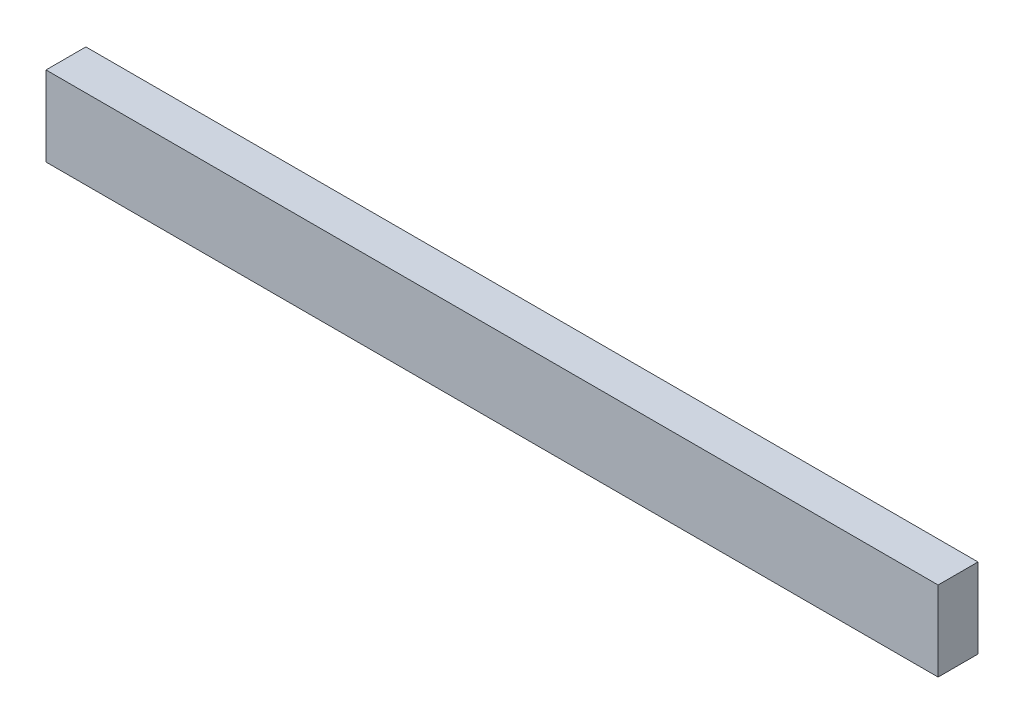
ISO-10303-21;
HEADER;
FILE_DESCRIPTION(('STEP AP214'),'2;1');
FILE_NAME('part.step','',(''),(''),'','','');
FILE_SCHEMA(('AUTOMOTIVE_DESIGN { 1 0 10303 214 1 1 1 1 }'));
ENDSEC;
DATA;
#1=APPLICATION_CONTEXT('core data for automotive mechanical design processes');
#2=APPLICATION_PROTOCOL_DEFINITION('international standard','automotive_design',2000,#1);
#3=PRODUCT_CONTEXT('',#1,'mechanical');
#4=PRODUCT('Part','Part','',(#3));
#5=PRODUCT_RELATED_PRODUCT_CATEGORY('part','',(#4));
#6=PRODUCT_DEFINITION_FORMATION('','',#4);
#7=PRODUCT_DEFINITION_CONTEXT('part definition',#1,'design');
#8=PRODUCT_DEFINITION('design','',#6,#7);
#9=PRODUCT_DEFINITION_SHAPE('','',#8);
#10=(LENGTH_UNIT() NAMED_UNIT(*) SI_UNIT(.MILLI.,.METRE.));
#11=(NAMED_UNIT(*) PLANE_ANGLE_UNIT() SI_UNIT($,.RADIAN.));
#12=(NAMED_UNIT(*) SI_UNIT($,.STERADIAN.) SOLID_ANGLE_UNIT());
#13=UNCERTAINTY_MEASURE_WITH_UNIT(LENGTH_MEASURE(1.E-05),#10,'distance_accuracy_value','');
#14=(GEOMETRIC_REPRESENTATION_CONTEXT(3) GLOBAL_UNCERTAINTY_ASSIGNED_CONTEXT((#13)) GLOBAL_UNIT_ASSIGNED_CONTEXT((#10,
#11,#12)) REPRESENTATION_CONTEXT('',''));
#15=CARTESIAN_POINT('',(0.,0.,0.));
#16=DIRECTION('',(0.,0.,1.));
#17=DIRECTION('',(1.,0.,0.));
#18=AXIS2_PLACEMENT_3D('',#15,#16,#17);
#19=CARTESIAN_POINT('',(568.,-25.4,-12.7));
#20=DIRECTION('',(0.,0.,1.));
#21=DIRECTION('',(1.,0.,0.));
#22=AXIS2_PLACEMENT_3D('',#19,#20,#21);
#23=PLANE('',#22);
#24=DIRECTION('',(0.,1.,0.));
#25=VECTOR('',#24,1.);
#26=CARTESIAN_POINT('',(0.,-25.4,-12.7));
#27=LINE('',#26,#25);
#28=CARTESIAN_POINT('',(0.,-25.4,-12.7));
#29=VERTEX_POINT('',#28);
#30=CARTESIAN_POINT('',(0.,25.4,-12.7));
#31=VERTEX_POINT('',#30);
#32=EDGE_CURVE('E96',#29,#31,#27,.T.);
#33=ORIENTED_EDGE('',*,*,#32,.T.);
#34=DIRECTION('',(-1.,0.,0.));
#35=VECTOR('',#34,1.);
#36=CARTESIAN_POINT('',(568.,25.4,-12.7));
#37=LINE('',#36,#35);
#38=CARTESIAN_POINT('',(568.,25.4,-12.7));
#39=VERTEX_POINT('',#38);
#40=EDGE_CURVE('E11',#39,#31,#37,.T.);
#41=ORIENTED_EDGE('',*,*,#40,.F.);
#42=DIRECTION('',(0.,1.,0.));
#43=VECTOR('',#42,1.);
#44=CARTESIAN_POINT('',(568.,-25.4,-12.7));
#45=LINE('',#44,#43);
#46=CARTESIAN_POINT('',(568.,-25.4,-12.7));
#47=VERTEX_POINT('',#46);
#48=EDGE_CURVE('E84',#47,#39,#45,.T.);
#49=ORIENTED_EDGE('',*,*,#48,.F.);
#50=DIRECTION('',(-1.,0.,0.));
#51=VECTOR('',#50,1.);
#52=CARTESIAN_POINT('',(568.,-25.4,-12.7));
#53=LINE('',#52,#51);
#54=EDGE_CURVE('E92',#47,#29,#53,.T.);
#55=ORIENTED_EDGE('',*,*,#54,.T.);
#56=EDGE_LOOP('',(#33,#41,#49,#55));
#57=FACE_BOUND('',#56,.T.);
#58=ADVANCED_FACE('F33',(#57),#23,.F.);
#59=CARTESIAN_POINT('',(568.,25.4,12.7));
#60=DIRECTION('',(0.,-1.,0.));
#61=DIRECTION('',(0.,0.,-1.));
#62=AXIS2_PLACEMENT_3D('',#59,#60,#61);
#63=PLANE('',#62);
#64=DIRECTION('',(0.,0.,1.));
#65=VECTOR('',#64,1.);
#66=CARTESIAN_POINT('',(0.,25.4,12.7));
#67=LINE('',#66,#65);
#68=CARTESIAN_POINT('',(0.,25.4,12.7));
#69=VERTEX_POINT('',#68);
#70=EDGE_CURVE('E88',#31,#69,#67,.T.);
#71=ORIENTED_EDGE('',*,*,#70,.T.);
#72=DIRECTION('',(-1.,0.,0.));
#73=VECTOR('',#72,1.);
#74=CARTESIAN_POINT('',(568.,25.4,12.7));
#75=LINE('',#74,#73);
#76=CARTESIAN_POINT('',(568.,25.4,12.7));
#77=VERTEX_POINT('',#76);
#78=EDGE_CURVE('E41',#77,#69,#75,.T.);
#79=ORIENTED_EDGE('',*,*,#78,.F.);
#80=DIRECTION('',(0.,0.,1.));
#81=VECTOR('',#80,1.);
#82=CARTESIAN_POINT('',(568.,25.4,12.7));
#83=LINE('',#82,#81);
#84=EDGE_CURVE('E79',#39,#77,#83,.T.);
#85=ORIENTED_EDGE('',*,*,#84,.F.);
#86=ORIENTED_EDGE('',*,*,#40,.T.);
#87=EDGE_LOOP('',(#71,#79,#85,#86));
#88=FACE_BOUND('',#87,.T.);
#89=ADVANCED_FACE('F87',(#88),#63,.F.);
#90=CARTESIAN_POINT('',(568.,-25.4,12.7));
#91=DIRECTION('',(0.,0.,-1.));
#92=DIRECTION('',(-1.,0.,0.));
#93=AXIS2_PLACEMENT_3D('',#90,#91,#92);
#94=PLANE('',#93);
#95=DIRECTION('',(0.,-1.,0.));
#96=VECTOR('',#95,1.);
#97=CARTESIAN_POINT('',(0.,-25.4,12.7));
#98=LINE('',#97,#96);
#99=CARTESIAN_POINT('',(0.,-25.4,12.7));
#100=VERTEX_POINT('',#99);
#101=EDGE_CURVE('E66',#69,#100,#98,.T.);
#102=ORIENTED_EDGE('',*,*,#101,.T.);
#103=DIRECTION('',(-1.,0.,0.));
#104=VECTOR('',#103,1.);
#105=CARTESIAN_POINT('',(568.,-25.4,12.7));
#106=LINE('',#105,#104);
#107=CARTESIAN_POINT('',(568.,-25.4,12.7));
#108=VERTEX_POINT('',#107);
#109=EDGE_CURVE('E89',#108,#100,#106,.T.);
#110=ORIENTED_EDGE('',*,*,#109,.F.);
#111=DIRECTION('',(0.,-1.,0.));
#112=VECTOR('',#111,1.);
#113=CARTESIAN_POINT('',(568.,-25.4,12.7));
#114=LINE('',#113,#112);
#115=EDGE_CURVE('E82',#77,#108,#114,.T.);
#116=ORIENTED_EDGE('',*,*,#115,.F.);
#117=ORIENTED_EDGE('',*,*,#78,.T.);
#118=EDGE_LOOP('',(#102,#110,#116,#117));
#119=FACE_BOUND('',#118,.T.);
#120=ADVANCED_FACE('F90',(#119),#94,.F.);
#121=CARTESIAN_POINT('',(568.,-25.4,12.7));
#122=DIRECTION('',(0.,1.,0.));
#123=DIRECTION('',(0.,0.,1.));
#124=AXIS2_PLACEMENT_3D('',#121,#122,#123);
#125=PLANE('',#124);
#126=DIRECTION('',(0.,0.,-1.));
#127=VECTOR('',#126,1.);
#128=CARTESIAN_POINT('',(0.,-25.4,12.7));
#129=LINE('',#128,#127);
#130=EDGE_CURVE('E72',#100,#29,#129,.T.);
#131=ORIENTED_EDGE('',*,*,#130,.T.);
#132=ORIENTED_EDGE('',*,*,#54,.F.);
#133=DIRECTION('',(0.,0.,-1.));
#134=VECTOR('',#133,1.);
#135=CARTESIAN_POINT('',(568.,-25.4,12.7));
#136=LINE('',#135,#134);
#137=EDGE_CURVE('E49',#108,#47,#136,.T.);
#138=ORIENTED_EDGE('',*,*,#137,.F.);
#139=ORIENTED_EDGE('',*,*,#109,.T.);
#140=EDGE_LOOP('',(#131,#132,#138,#139));
#141=FACE_BOUND('',#140,.T.);
#142=ADVANCED_FACE('F103',(#141),#125,.F.);
#143=CARTESIAN_POINT('',(568.,0.,0.));
#144=DIRECTION('',(-1.,0.,0.));
#145=DIRECTION('',(0.,0.,1.));
#146=AXIS2_PLACEMENT_3D('',#143,#144,#145);
#147=PLANE('',#146);
#148=ORIENTED_EDGE('',*,*,#48,.T.);
#149=ORIENTED_EDGE('',*,*,#84,.T.);
#150=ORIENTED_EDGE('',*,*,#115,.T.);
#151=ORIENTED_EDGE('',*,*,#137,.T.);
#152=EDGE_LOOP('',(#148,#149,#150,#151));
#153=FACE_BOUND('',#152,.T.);
#154=ADVANCED_FACE('F80',(#153),#147,.F.);
#155=CARTESIAN_POINT('',(0.,0.,0.));
#156=DIRECTION('',(-1.,0.,0.));
#157=DIRECTION('',(0.,0.,1.));
#158=AXIS2_PLACEMENT_3D('',#155,#156,#157);
#159=PLANE('',#158);
#160=ORIENTED_EDGE('',*,*,#32,.F.);
#161=ORIENTED_EDGE('',*,*,#130,.F.);
#162=ORIENTED_EDGE('',*,*,#101,.F.);
#163=ORIENTED_EDGE('',*,*,#70,.F.);
#164=EDGE_LOOP('',(#160,#161,#162,#163));
#165=FACE_BOUND('',#164,.T.);
#166=ADVANCED_FACE('F106',(#165),#159,.T.);
#167=CLOSED_SHELL('',(#58,#89,#120,#142,#154,#166));
#168=MANIFOLD_SOLID_BREP('B2',#167);
#169=ADVANCED_BREP_SHAPE_REPRESENTATION('',(#18,#168),#14);
#170=SHAPE_DEFINITION_REPRESENTATION(#9,#169);
ENDSEC;
END-ISO-10303-21;
